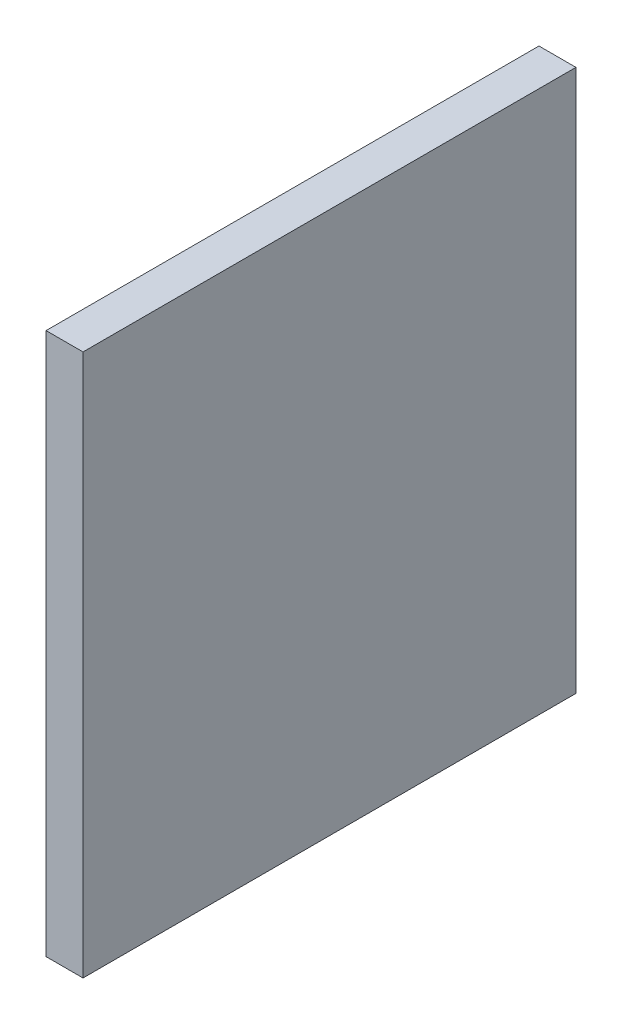
ISO-10303-21;
HEADER;
FILE_DESCRIPTION(('STEP AP214'),'2;1');
FILE_NAME('part.step','',(''),(''),'','','');
FILE_SCHEMA(('AUTOMOTIVE_DESIGN { 1 0 10303 214 1 1 1 1 }'));
ENDSEC;
DATA;
#1=APPLICATION_CONTEXT('core data for automotive mechanical design processes');
#2=APPLICATION_PROTOCOL_DEFINITION('international standard','automotive_design',2000,#1);
#3=PRODUCT_CONTEXT('',#1,'mechanical');
#4=PRODUCT('Part','Part','',(#3));
#5=PRODUCT_RELATED_PRODUCT_CATEGORY('part','',(#4));
#6=PRODUCT_DEFINITION_FORMATION('','',#4);
#7=PRODUCT_DEFINITION_CONTEXT('part definition',#1,'design');
#8=PRODUCT_DEFINITION('design','',#6,#7);
#9=PRODUCT_DEFINITION_SHAPE('','',#8);
#10=(LENGTH_UNIT() NAMED_UNIT(*) SI_UNIT(.MILLI.,.METRE.));
#11=(NAMED_UNIT(*) PLANE_ANGLE_UNIT() SI_UNIT($,.RADIAN.));
#12=(NAMED_UNIT(*) SI_UNIT($,.STERADIAN.) SOLID_ANGLE_UNIT());
#13=UNCERTAINTY_MEASURE_WITH_UNIT(LENGTH_MEASURE(1.E-05),#10,'distance_accuracy_value','');
#14=(GEOMETRIC_REPRESENTATION_CONTEXT(3) GLOBAL_UNCERTAINTY_ASSIGNED_CONTEXT((#13)) GLOBAL_UNIT_ASSIGNED_CONTEXT((#10,
#11,#12)) REPRESENTATION_CONTEXT('',''));
#15=CARTESIAN_POINT('',(0.,0.,0.));
#16=DIRECTION('',(0.,0.,1.));
#17=DIRECTION('',(1.,0.,0.));
#18=AXIS2_PLACEMENT_3D('',#15,#16,#17);
#19=CARTESIAN_POINT('',(64.6371308016878,-0.0100000000000031,7.15189873417722));
#20=DIRECTION('',(0.,0.,1.));
#21=DIRECTION('',(1.,0.,0.));
#22=AXIS2_PLACEMENT_3D('',#19,#20,#21);
#23=PLANE('',#22);
#24=DIRECTION('',(-1.,0.,0.));
#25=VECTOR('',#24,1.);
#26=CARTESIAN_POINT('',(0.,3.,7.15189873417722));
#27=LINE('',#26,#25);
#28=CARTESIAN_POINT('',(67.6371308016878,3.,7.15189873417722));
#29=VERTEX_POINT('',#28);
#30=CARTESIAN_POINT('',(64.6371308016878,3.,7.15189873417722));
#31=VERTEX_POINT('',#30);
#32=EDGE_CURVE('E93',#29,#31,#27,.T.);
#33=ORIENTED_EDGE('',*,*,#32,.F.);
#34=DIRECTION('',(0.,1.,0.));
#35=VECTOR('',#34,1.);
#36=CARTESIAN_POINT('',(67.6371308016878,-0.0100000000000031,7.15189873417722));
#37=LINE('',#36,#35);
#38=CARTESIAN_POINT('',(67.6371308016878,47.,7.15189873417722));
#39=VERTEX_POINT('',#38);
#40=EDGE_CURVE('E81',#29,#39,#37,.T.);
#41=ORIENTED_EDGE('',*,*,#40,.T.);
#42=DIRECTION('',(1.,0.,0.));
#43=VECTOR('',#42,1.);
#44=CARTESIAN_POINT('',(0.,47.,7.15189873417722));
#45=LINE('',#44,#43);
#46=CARTESIAN_POINT('',(64.6371308016878,47.,7.15189873417722));
#47=VERTEX_POINT('',#46);
#48=EDGE_CURVE('E89',#47,#39,#45,.T.);
#49=ORIENTED_EDGE('',*,*,#48,.F.);
#50=DIRECTION('',(0.,1.,0.));
#51=VECTOR('',#50,1.);
#52=CARTESIAN_POINT('',(64.6371308016878,47.,7.15189873417722));
#53=LINE('',#52,#51);
#54=EDGE_CURVE('E49',#31,#47,#53,.T.);
#55=ORIENTED_EDGE('',*,*,#54,.F.);
#56=EDGE_LOOP('',(#33,#41,#49,#55));
#57=FACE_BOUND('',#56,.T.);
#58=ADVANCED_FACE('F32',(#57),#23,.T.);
#59=CARTESIAN_POINT('',(64.6371308016878,-0.0100000000000031,-32.8481012658228));
#60=DIRECTION('',(0.,0.,-1.));
#61=DIRECTION('',(-1.,0.,0.));
#62=AXIS2_PLACEMENT_3D('',#59,#60,#61);
#63=PLANE('',#62);
#64=DIRECTION('',(1.,0.,0.));
#65=VECTOR('',#64,1.);
#66=CARTESIAN_POINT('',(0.,3.,-32.8481012658228));
#67=LINE('',#66,#65);
#68=CARTESIAN_POINT('',(64.6371308016878,3.,-32.8481012658228));
#69=VERTEX_POINT('',#68);
#70=CARTESIAN_POINT('',(67.6371308016878,3.,-32.8481012658228));
#71=VERTEX_POINT('',#70);
#72=EDGE_CURVE('E99',#69,#71,#67,.T.);
#73=ORIENTED_EDGE('',*,*,#72,.F.);
#74=DIRECTION('',(0.,-1.,0.));
#75=VECTOR('',#74,1.);
#76=CARTESIAN_POINT('',(64.6371308016878,47.,-32.8481012658228));
#77=LINE('',#76,#75);
#78=CARTESIAN_POINT('',(64.6371308016878,47.,-32.8481012658228));
#79=VERTEX_POINT('',#78);
#80=EDGE_CURVE('E57',#79,#69,#77,.T.);
#81=ORIENTED_EDGE('',*,*,#80,.F.);
#82=DIRECTION('',(-1.,0.,0.));
#83=VECTOR('',#82,1.);
#84=CARTESIAN_POINT('',(0.,47.,-32.8481012658228));
#85=LINE('',#84,#83);
#86=CARTESIAN_POINT('',(67.6371308016878,47.,-32.8481012658228));
#87=VERTEX_POINT('',#86);
#88=EDGE_CURVE('E91',#87,#79,#85,.T.);
#89=ORIENTED_EDGE('',*,*,#88,.F.);
#90=DIRECTION('',(0.,-1.,0.));
#91=VECTOR('',#90,1.);
#92=CARTESIAN_POINT('',(67.6371308016878,50.,-32.8481012658228));
#93=LINE('',#92,#91);
#94=EDGE_CURVE('E36',#87,#71,#93,.T.);
#95=ORIENTED_EDGE('',*,*,#94,.T.);
#96=EDGE_LOOP('',(#73,#81,#89,#95));
#97=FACE_BOUND('',#96,.T.);
#98=ADVANCED_FACE('F110',(#97),#63,.T.);
#99=CARTESIAN_POINT('',(67.6371308016878,50.,-47.8481012658228));
#100=DIRECTION('',(-1.,0.,0.));
#101=DIRECTION('',(0.,0.,1.));
#102=AXIS2_PLACEMENT_3D('',#99,#100,#101);
#103=PLANE('',#102);
#104=ORIENTED_EDGE('',*,*,#40,.F.);
#105=DIRECTION('',(0.,0.,1.));
#106=VECTOR('',#105,1.);
#107=CARTESIAN_POINT('',(67.6371308016878,3.,-47.8481012658228));
#108=LINE('',#107,#106);
#109=EDGE_CURVE('E41',#71,#29,#108,.T.);
#110=ORIENTED_EDGE('',*,*,#109,.F.);
#111=ORIENTED_EDGE('',*,*,#94,.F.);
#112=DIRECTION('',(0.,0.,-1.));
#113=VECTOR('',#112,1.);
#114=CARTESIAN_POINT('',(67.6371308016878,47.,-47.8481012658228));
#115=LINE('',#114,#113);
#116=EDGE_CURVE('E77',#39,#87,#115,.T.);
#117=ORIENTED_EDGE('',*,*,#116,.F.);
#118=EDGE_LOOP('',(#104,#110,#111,#117));
#119=FACE_BOUND('',#118,.T.);
#120=ADVANCED_FACE('F79',(#119),#103,.F.);
#121=CARTESIAN_POINT('',(0.,47.,0.));
#122=DIRECTION('',(0.,1.,0.));
#123=DIRECTION('',(0.,0.,1.));
#124=AXIS2_PLACEMENT_3D('',#121,#122,#123);
#125=PLANE('',#124);
#126=DIRECTION('',(0.,0.,-1.));
#127=VECTOR('',#126,1.);
#128=CARTESIAN_POINT('',(64.6371308016878,47.,-47.8481012658228));
#129=LINE('',#128,#127);
#130=EDGE_CURVE('E86',#47,#79,#129,.T.);
#131=ORIENTED_EDGE('',*,*,#130,.F.);
#132=ORIENTED_EDGE('',*,*,#48,.T.);
#133=ORIENTED_EDGE('',*,*,#116,.T.);
#134=ORIENTED_EDGE('',*,*,#88,.T.);
#135=EDGE_LOOP('',(#131,#132,#133,#134));
#136=FACE_BOUND('',#135,.T.);
#137=ADVANCED_FACE('F90',(#136),#125,.T.);
#138=CARTESIAN_POINT('',(0.,3.,0.));
#139=DIRECTION('',(0.,-1.,0.));
#140=DIRECTION('',(0.,0.,-1.));
#141=AXIS2_PLACEMENT_3D('',#138,#139,#140);
#142=PLANE('',#141);
#143=ORIENTED_EDGE('',*,*,#109,.T.);
#144=ORIENTED_EDGE('',*,*,#32,.T.);
#145=DIRECTION('',(0.,0.,-1.));
#146=VECTOR('',#145,1.);
#147=CARTESIAN_POINT('',(64.6371308016878,3.,-47.8481012658228));
#148=LINE('',#147,#146);
#149=EDGE_CURVE('E11',#31,#69,#148,.T.);
#150=ORIENTED_EDGE('',*,*,#149,.T.);
#151=ORIENTED_EDGE('',*,*,#72,.T.);
#152=EDGE_LOOP('',(#143,#144,#150,#151));
#153=FACE_BOUND('',#152,.T.);
#154=ADVANCED_FACE('F104',(#153),#142,.T.);
#155=CARTESIAN_POINT('',(64.6371308016878,47.,-47.8481012658228));
#156=DIRECTION('',(-1.,0.,0.));
#157=DIRECTION('',(0.,0.,1.));
#158=AXIS2_PLACEMENT_3D('',#155,#156,#157);
#159=PLANE('',#158);
#160=ORIENTED_EDGE('',*,*,#149,.F.);
#161=ORIENTED_EDGE('',*,*,#54,.T.);
#162=ORIENTED_EDGE('',*,*,#130,.T.);
#163=ORIENTED_EDGE('',*,*,#80,.T.);
#164=EDGE_LOOP('',(#160,#161,#162,#163));
#165=FACE_BOUND('',#164,.T.);
#166=ADVANCED_FACE('F34',(#165),#159,.T.);
#167=CLOSED_SHELL('',(#58,#98,#120,#137,#154,#166));
#168=MANIFOLD_SOLID_BREP('B2',#167);
#169=ADVANCED_BREP_SHAPE_REPRESENTATION('',(#18,#168),#14);
#170=SHAPE_DEFINITION_REPRESENTATION(#9,#169);
ENDSEC;
END-ISO-10303-21;
